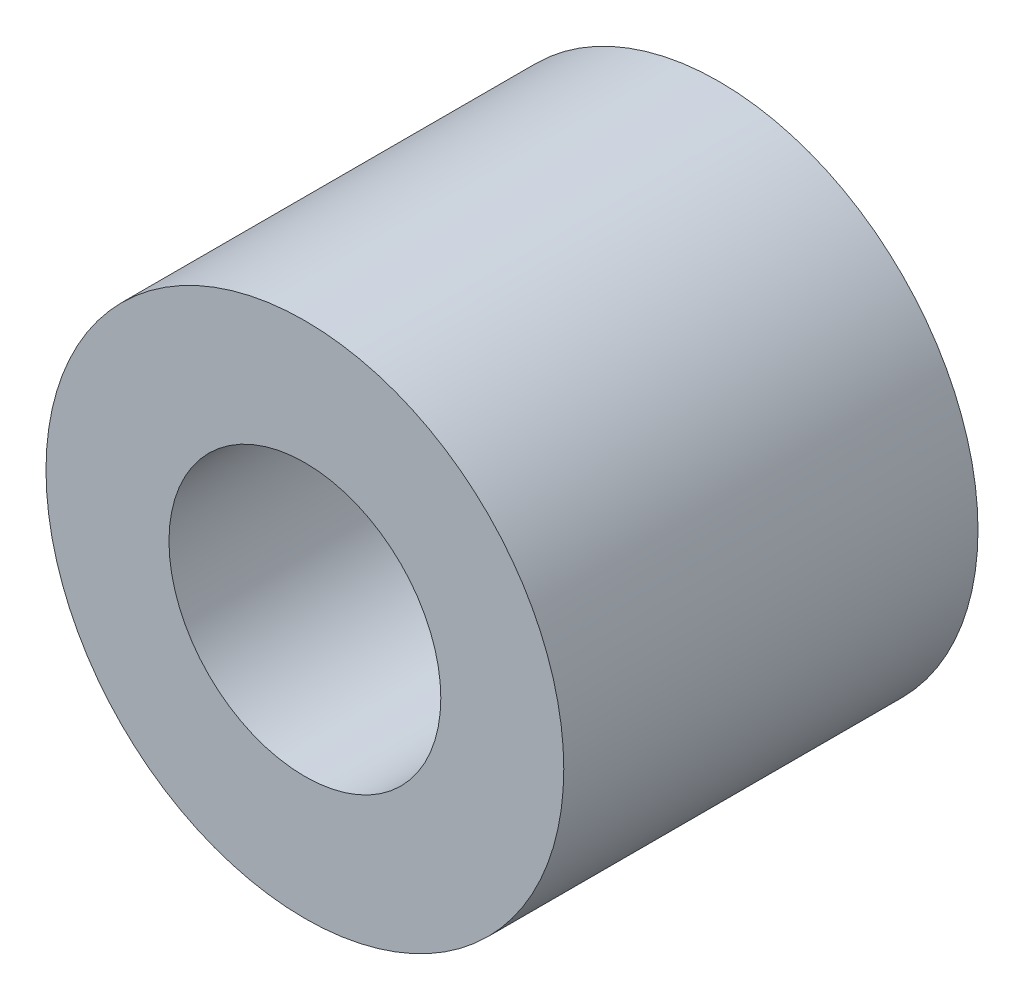
ISO-10303-21;
HEADER;
FILE_DESCRIPTION(('STEP AP214'),'2;1');
FILE_NAME('part.step','',(''),(''),'','','');
FILE_SCHEMA(('AUTOMOTIVE_DESIGN { 1 0 10303 214 1 1 1 1 }'));
ENDSEC;
DATA;
#1=APPLICATION_CONTEXT('core data for automotive mechanical design processes');
#2=APPLICATION_PROTOCOL_DEFINITION('international standard','automotive_design',2000,#1);
#3=PRODUCT_CONTEXT('',#1,'mechanical');
#4=PRODUCT('Part','Part','',(#3));
#5=PRODUCT_RELATED_PRODUCT_CATEGORY('part','',(#4));
#6=PRODUCT_DEFINITION_FORMATION('','',#4);
#7=PRODUCT_DEFINITION_CONTEXT('part definition',#1,'design');
#8=PRODUCT_DEFINITION('design','',#6,#7);
#9=PRODUCT_DEFINITION_SHAPE('','',#8);
#10=(LENGTH_UNIT() NAMED_UNIT(*) SI_UNIT(.MILLI.,.METRE.));
#11=(NAMED_UNIT(*) PLANE_ANGLE_UNIT() SI_UNIT($,.RADIAN.));
#12=(NAMED_UNIT(*) SI_UNIT($,.STERADIAN.) SOLID_ANGLE_UNIT());
#13=UNCERTAINTY_MEASURE_WITH_UNIT(LENGTH_MEASURE(1.E-05),#10,'distance_accuracy_value','');
#14=(GEOMETRIC_REPRESENTATION_CONTEXT(3) GLOBAL_UNCERTAINTY_ASSIGNED_CONTEXT((#13)) GLOBAL_UNIT_ASSIGNED_CONTEXT((#10,
#11,#12)) REPRESENTATION_CONTEXT('',''));
#15=CARTESIAN_POINT('',(0.,0.,0.));
#16=DIRECTION('',(0.,0.,1.));
#17=DIRECTION('',(1.,0.,0.));
#18=AXIS2_PLACEMENT_3D('',#15,#16,#17);
#19=CARTESIAN_POINT('',(0.,0.,6.4));
#20=DIRECTION('',(0.,0.,1.));
#21=DIRECTION('',(1.,0.,0.));
#22=AXIS2_PLACEMENT_3D('',#19,#20,#21);
#23=PLANE('',#22);
#24=CARTESIAN_POINT('',(0.,0.,6.4));
#25=DIRECTION('',(0.,0.,1.));
#26=DIRECTION('',(1.,0.,0.));
#27=AXIS2_PLACEMENT_3D('',#24,#25,#26);
#28=CIRCLE('',#27,4.);
#29=CARTESIAN_POINT('',(4.,0.,6.4));
#30=VERTEX_POINT('',#29);
#31=EDGE_CURVE('E10',#30,#30,#28,.T.);
#32=ORIENTED_EDGE('',*,*,#31,.T.);
#33=EDGE_LOOP('',(#32));
#34=FACE_BOUND('',#33,.T.);
#35=CARTESIAN_POINT('',(0.,0.,6.4));
#36=DIRECTION('',(0.,0.,1.));
#37=DIRECTION('',(1.,0.,0.));
#38=AXIS2_PLACEMENT_3D('',#35,#36,#37);
#39=CIRCLE('',#38,2.1);
#40=CARTESIAN_POINT('',(2.1,0.,6.4));
#41=VERTEX_POINT('',#40);
#42=EDGE_CURVE('E42',#41,#41,#39,.T.);
#43=ORIENTED_EDGE('',*,*,#42,.F.);
#44=EDGE_LOOP('',(#43));
#45=FACE_BOUND('',#44,.T.);
#46=ADVANCED_FACE('F31',(#34,#45),#23,.T.);
#47=CARTESIAN_POINT('',(0.,0.,0.));
#48=DIRECTION('',(0.,0.,1.));
#49=DIRECTION('',(1.,0.,0.));
#50=AXIS2_PLACEMENT_3D('',#47,#48,#49);
#51=PLANE('',#50);
#52=CARTESIAN_POINT('',(0.,0.,0.));
#53=DIRECTION('',(0.,0.,1.));
#54=DIRECTION('',(1.,0.,0.));
#55=AXIS2_PLACEMENT_3D('',#52,#53,#54);
#56=CIRCLE('',#55,4.);
#57=CARTESIAN_POINT('',(4.,0.,0.));
#58=VERTEX_POINT('',#57);
#59=EDGE_CURVE('E35',#58,#58,#56,.T.);
#60=ORIENTED_EDGE('',*,*,#59,.F.);
#61=EDGE_LOOP('',(#60));
#62=FACE_BOUND('',#61,.T.);
#63=CARTESIAN_POINT('',(0.,0.,0.));
#64=DIRECTION('',(0.,0.,1.));
#65=DIRECTION('',(1.,0.,0.));
#66=AXIS2_PLACEMENT_3D('',#63,#64,#65);
#67=CIRCLE('',#66,2.1);
#68=CARTESIAN_POINT('',(2.1,0.,0.));
#69=VERTEX_POINT('',#68);
#70=EDGE_CURVE('E44',#69,#69,#67,.T.);
#71=ORIENTED_EDGE('',*,*,#70,.T.);
#72=EDGE_LOOP('',(#71));
#73=FACE_BOUND('',#72,.T.);
#74=ADVANCED_FACE('F54',(#62,#73),#51,.F.);
#75=CARTESIAN_POINT('',(0.,0.,6.4));
#76=DIRECTION('',(0.,0.,-1.));
#77=DIRECTION('',(-1.,0.,0.));
#78=AXIS2_PLACEMENT_3D('',#75,#76,#77);
#79=CYLINDRICAL_SURFACE('',#78,4.);
#80=ORIENTED_EDGE('',*,*,#31,.F.);
#81=EDGE_LOOP('',(#80));
#82=FACE_BOUND('',#81,.T.);
#83=ORIENTED_EDGE('',*,*,#59,.T.);
#84=EDGE_LOOP('',(#83));
#85=FACE_BOUND('',#84,.T.);
#86=ADVANCED_FACE('F33',(#82,#85),#79,.T.);
#87=CARTESIAN_POINT('',(0.,0.,6.4));
#88=DIRECTION('',(0.,0.,-1.));
#89=DIRECTION('',(-1.,0.,0.));
#90=AXIS2_PLACEMENT_3D('',#87,#88,#89);
#91=CYLINDRICAL_SURFACE('',#90,2.1);
#92=ORIENTED_EDGE('',*,*,#42,.T.);
#93=EDGE_LOOP('',(#92));
#94=FACE_BOUND('',#93,.T.);
#95=ORIENTED_EDGE('',*,*,#70,.F.);
#96=EDGE_LOOP('',(#95));
#97=FACE_BOUND('',#96,.T.);
#98=ADVANCED_FACE('F50',(#94,#97),#91,.F.);
#99=CLOSED_SHELL('',(#46,#74,#86,#98));
#100=MANIFOLD_SOLID_BREP('B2',#99);
#101=ADVANCED_BREP_SHAPE_REPRESENTATION('',(#18,#100),#14);
#102=SHAPE_DEFINITION_REPRESENTATION(#9,#101);
ENDSEC;
END-ISO-10303-21;
